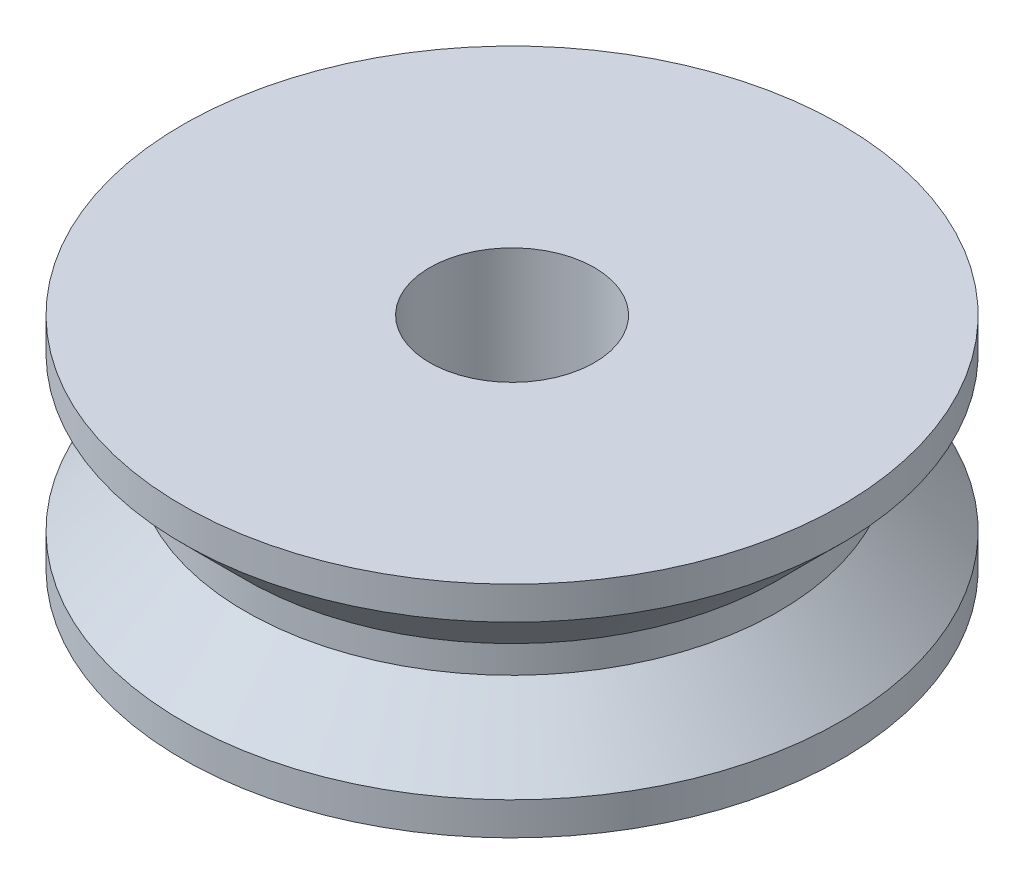
ISO-10303-21;
HEADER;
FILE_DESCRIPTION(('STEP AP214'),'2;1');
FILE_NAME('part.step','',(''),(''),'','','');
FILE_SCHEMA(('AUTOMOTIVE_DESIGN { 1 0 10303 214 1 1 1 1 }'));
ENDSEC;
DATA;
#1=APPLICATION_CONTEXT('core data for automotive mechanical design processes');
#2=APPLICATION_PROTOCOL_DEFINITION('international standard','automotive_design',2000,#1);
#3=PRODUCT_CONTEXT('',#1,'mechanical');
#4=PRODUCT('Part','Part','',(#3));
#5=PRODUCT_RELATED_PRODUCT_CATEGORY('part','',(#4));
#6=PRODUCT_DEFINITION_FORMATION('','',#4);
#7=PRODUCT_DEFINITION_CONTEXT('part definition',#1,'design');
#8=PRODUCT_DEFINITION('design','',#6,#7);
#9=PRODUCT_DEFINITION_SHAPE('','',#8);
#10=(LENGTH_UNIT() NAMED_UNIT(*) SI_UNIT(.MILLI.,.METRE.));
#11=(NAMED_UNIT(*) PLANE_ANGLE_UNIT() SI_UNIT($,.RADIAN.));
#12=(NAMED_UNIT(*) SI_UNIT($,.STERADIAN.) SOLID_ANGLE_UNIT());
#13=UNCERTAINTY_MEASURE_WITH_UNIT(LENGTH_MEASURE(1.E-05),#10,'distance_accuracy_value','');
#14=(GEOMETRIC_REPRESENTATION_CONTEXT(3) GLOBAL_UNCERTAINTY_ASSIGNED_CONTEXT((#13)) GLOBAL_UNIT_ASSIGNED_CONTEXT((#10,
#11,#12)) REPRESENTATION_CONTEXT('',''));
#15=CARTESIAN_POINT('',(0.,0.,0.));
#16=DIRECTION('',(0.,0.,1.));
#17=DIRECTION('',(1.,0.,0.));
#18=AXIS2_PLACEMENT_3D('',#15,#16,#17);
#19=CARTESIAN_POINT('',(6.,0.,0.));
#20=DIRECTION('',(0.,-1.,0.));
#21=DIRECTION('',(0.,0.,-1.));
#22=AXIS2_PLACEMENT_3D('',#19,#20,#21);
#23=PLANE('',#22);
#24=CARTESIAN_POINT('',(0.,0.,0.));
#25=DIRECTION('',(0.,-1.,0.));
#26=DIRECTION('',(0.,0.,-1.));
#27=AXIS2_PLACEMENT_3D('',#24,#25,#26);
#28=CIRCLE('',#27,6.);
#29=CARTESIAN_POINT('',(0.,0.,-6.));
#30=VERTEX_POINT('',#29);
#31=EDGE_CURVE('E60',#30,#30,#28,.T.);
#32=ORIENTED_EDGE('',*,*,#31,.T.);
#33=EDGE_LOOP('',(#32));
#34=FACE_BOUND('',#33,.T.);
#35=CARTESIAN_POINT('',(0.,0.,0.));
#36=DIRECTION('',(0.,-1.,0.));
#37=DIRECTION('',(0.,0.,-1.));
#38=AXIS2_PLACEMENT_3D('',#35,#36,#37);
#39=CIRCLE('',#38,1.5);
#40=CARTESIAN_POINT('',(0.,0.,-1.5));
#41=VERTEX_POINT('',#40);
#42=EDGE_CURVE('E10',#41,#41,#39,.T.);
#43=ORIENTED_EDGE('',*,*,#42,.F.);
#44=EDGE_LOOP('',(#43));
#45=FACE_BOUND('',#44,.T.);
#46=ADVANCED_FACE('F32',(#34,#45),#23,.T.);
#47=CARTESIAN_POINT('',(0.,0.,0.));
#48=DIRECTION('',(0.,-1.,0.));
#49=DIRECTION('',(0.,0.,-1.));
#50=AXIS2_PLACEMENT_3D('',#47,#48,#49);
#51=CYLINDRICAL_SURFACE('',#50,1.5);
#52=ORIENTED_EDGE('',*,*,#42,.T.);
#53=EDGE_LOOP('',(#52));
#54=FACE_BOUND('',#53,.T.);
#55=CARTESIAN_POINT('',(0.,4.,0.));
#56=DIRECTION('',(0.,-1.,0.));
#57=DIRECTION('',(0.,0.,-1.));
#58=AXIS2_PLACEMENT_3D('',#55,#56,#57);
#59=CIRCLE('',#58,1.5);
#60=CARTESIAN_POINT('',(0.,4.,-1.5));
#61=VERTEX_POINT('',#60);
#62=EDGE_CURVE('E38',#61,#61,#59,.T.);
#63=ORIENTED_EDGE('',*,*,#62,.F.);
#64=EDGE_LOOP('',(#63));
#65=FACE_BOUND('',#64,.T.);
#66=ADVANCED_FACE('F78',(#54,#65),#51,.F.);
#67=CARTESIAN_POINT('',(1.5,4.,0.));
#68=DIRECTION('',(0.,1.,0.));
#69=DIRECTION('',(0.,0.,1.));
#70=AXIS2_PLACEMENT_3D('',#67,#68,#69);
#71=PLANE('',#70);
#72=ORIENTED_EDGE('',*,*,#62,.T.);
#73=EDGE_LOOP('',(#72));
#74=FACE_BOUND('',#73,.T.);
#75=CARTESIAN_POINT('',(0.,4.,0.));
#76=DIRECTION('',(0.,-1.,0.));
#77=DIRECTION('',(0.,0.,-1.));
#78=AXIS2_PLACEMENT_3D('',#75,#76,#77);
#79=CIRCLE('',#78,6.);
#80=CARTESIAN_POINT('',(0.,4.,-6.));
#81=VERTEX_POINT('',#80);
#82=EDGE_CURVE('E42',#81,#81,#79,.T.);
#83=ORIENTED_EDGE('',*,*,#82,.F.);
#84=EDGE_LOOP('',(#83));
#85=FACE_BOUND('',#84,.T.);
#86=ADVANCED_FACE('F82',(#74,#85),#71,.T.);
#87=CARTESIAN_POINT('',(0.,0.,0.));
#88=DIRECTION('',(0.,-1.,0.));
#89=DIRECTION('',(0.,0.,-1.));
#90=AXIS2_PLACEMENT_3D('',#87,#88,#89);
#91=CYLINDRICAL_SURFACE('',#90,6.);
#92=ORIENTED_EDGE('',*,*,#82,.T.);
#93=EDGE_LOOP('',(#92));
#94=FACE_BOUND('',#93,.T.);
#95=CARTESIAN_POINT('',(0.,3.4,0.));
#96=DIRECTION('',(0.,-1.,0.));
#97=DIRECTION('',(0.,0.,-1.));
#98=AXIS2_PLACEMENT_3D('',#95,#96,#97);
#99=CIRCLE('',#98,6.);
#100=CARTESIAN_POINT('',(0.,3.4,-6.));
#101=VERTEX_POINT('',#100);
#102=EDGE_CURVE('E46',#101,#101,#99,.T.);
#103=ORIENTED_EDGE('',*,*,#102,.F.);
#104=EDGE_LOOP('',(#103));
#105=FACE_BOUND('',#104,.T.);
#106=ADVANCED_FACE('F86',(#94,#105),#91,.T.);
#107=CARTESIAN_POINT('',(0.,2.25,0.));
#108=DIRECTION('',(0.,1.,0.));
#109=DIRECTION('',(0.,0.,1.));
#110=AXIS2_PLACEMENT_3D('',#107,#108,#109);
#111=CONICAL_SURFACE('',#110,4.85,0.785398163397448);
#112=ORIENTED_EDGE('',*,*,#102,.T.);
#113=EDGE_LOOP('',(#112));
#114=FACE_BOUND('',#113,.T.);
#115=CARTESIAN_POINT('',(0.,2.25,0.));
#116=DIRECTION('',(0.,-1.,0.));
#117=DIRECTION('',(0.,0.,-1.));
#118=AXIS2_PLACEMENT_3D('',#115,#116,#117);
#119=CIRCLE('',#118,4.85);
#120=CARTESIAN_POINT('',(0.,2.25,-4.85));
#121=VERTEX_POINT('',#120);
#122=EDGE_CURVE('E51',#121,#121,#119,.T.);
#123=ORIENTED_EDGE('',*,*,#122,.F.);
#124=EDGE_LOOP('',(#123));
#125=FACE_BOUND('',#124,.T.);
#126=ADVANCED_FACE('F92',(#114,#125),#111,.T.);
#127=CARTESIAN_POINT('',(0.,0.,0.));
#128=DIRECTION('',(0.,-1.,0.));
#129=DIRECTION('',(0.,0.,-1.));
#130=AXIS2_PLACEMENT_3D('',#127,#128,#129);
#131=CYLINDRICAL_SURFACE('',#130,4.85);
#132=ORIENTED_EDGE('',*,*,#122,.T.);
#133=EDGE_LOOP('',(#132));
#134=FACE_BOUND('',#133,.T.);
#135=CARTESIAN_POINT('',(0.,1.75,0.));
#136=DIRECTION('',(0.,-1.,0.));
#137=DIRECTION('',(0.,0.,-1.));
#138=AXIS2_PLACEMENT_3D('',#135,#136,#137);
#139=CIRCLE('',#138,4.85);
#140=CARTESIAN_POINT('',(0.,1.75,-4.85));
#141=VERTEX_POINT('',#140);
#142=EDGE_CURVE('E54',#141,#141,#139,.T.);
#143=ORIENTED_EDGE('',*,*,#142,.F.);
#144=EDGE_LOOP('',(#143));
#145=FACE_BOUND('',#144,.T.);
#146=ADVANCED_FACE('F74',(#134,#145),#131,.T.);
#147=CARTESIAN_POINT('',(0.,0.6,0.));
#148=DIRECTION('',(0.,-1.,0.));
#149=DIRECTION('',(0.,0.,-1.));
#150=AXIS2_PLACEMENT_3D('',#147,#148,#149);
#151=CONICAL_SURFACE('',#150,6.,0.785398163397447);
#152=ORIENTED_EDGE('',*,*,#142,.T.);
#153=EDGE_LOOP('',(#152));
#154=FACE_BOUND('',#153,.T.);
#155=CARTESIAN_POINT('',(0.,0.6,0.));
#156=DIRECTION('',(0.,-1.,0.));
#157=DIRECTION('',(0.,0.,-1.));
#158=AXIS2_PLACEMENT_3D('',#155,#156,#157);
#159=CIRCLE('',#158,6.);
#160=CARTESIAN_POINT('',(0.,0.6,-6.));
#161=VERTEX_POINT('',#160);
#162=EDGE_CURVE('E57',#161,#161,#159,.T.);
#163=ORIENTED_EDGE('',*,*,#162,.F.);
#164=EDGE_LOOP('',(#163));
#165=FACE_BOUND('',#164,.T.);
#166=ADVANCED_FACE('F68',(#154,#165),#151,.T.);
#167=CARTESIAN_POINT('',(0.,0.,0.));
#168=DIRECTION('',(0.,-1.,0.));
#169=DIRECTION('',(0.,0.,-1.));
#170=AXIS2_PLACEMENT_3D('',#167,#168,#169);
#171=CYLINDRICAL_SURFACE('',#170,6.);
#172=ORIENTED_EDGE('',*,*,#162,.T.);
#173=EDGE_LOOP('',(#172));
#174=FACE_BOUND('',#173,.T.);
#175=ORIENTED_EDGE('',*,*,#31,.F.);
#176=EDGE_LOOP('',(#175));
#177=FACE_BOUND('',#176,.T.);
#178=ADVANCED_FACE('F66',(#174,#177),#171,.T.);
#179=CLOSED_SHELL('',(#46,#66,#86,#106,#126,#146,#166,#178));
#180=MANIFOLD_SOLID_BREP('B2',#179);
#181=ADVANCED_BREP_SHAPE_REPRESENTATION('',(#18,#180),#14);
#182=SHAPE_DEFINITION_REPRESENTATION(#9,#181);
ENDSEC;
END-ISO-10303-21;
